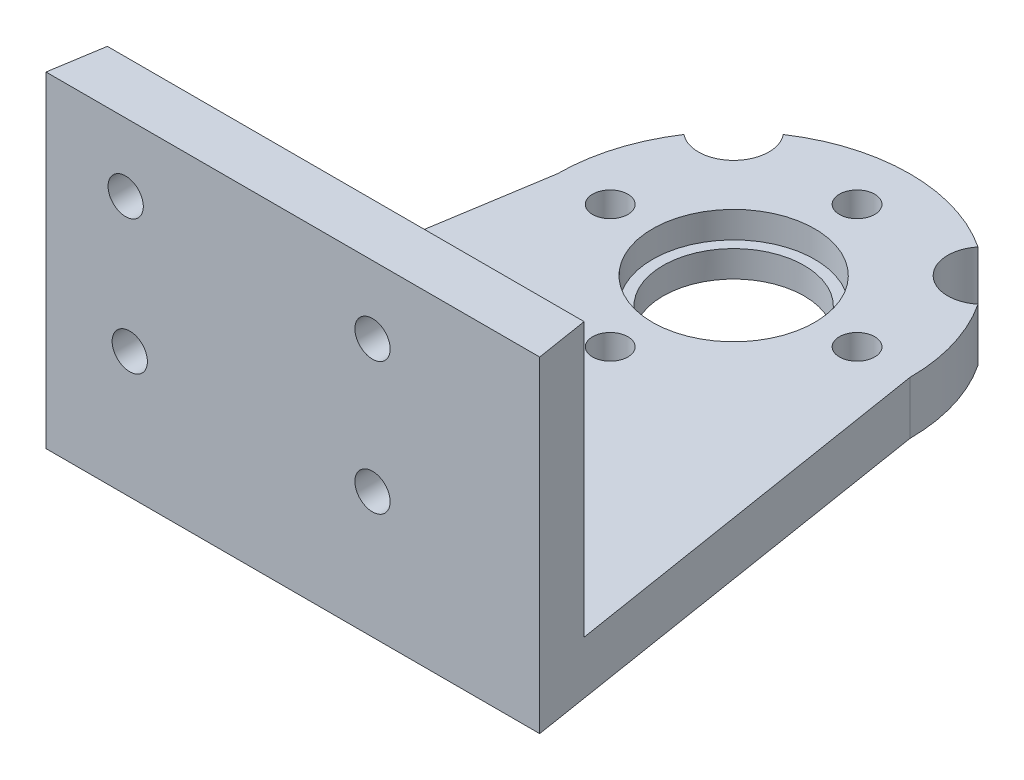
ISO-10303-21;
HEADER;
FILE_DESCRIPTION(('STEP AP214'),'2;1');
FILE_NAME('part.step','',(''),(''),'','','');
FILE_SCHEMA(('AUTOMOTIVE_DESIGN { 1 0 10303 214 1 1 1 1 }'));
ENDSEC;
DATA;
#1=APPLICATION_CONTEXT('core data for automotive mechanical design processes');
#2=APPLICATION_PROTOCOL_DEFINITION('international standard','automotive_design',2000,#1);
#3=PRODUCT_CONTEXT('',#1,'mechanical');
#4=PRODUCT('Part','Part','',(#3));
#5=PRODUCT_RELATED_PRODUCT_CATEGORY('part','',(#4));
#6=PRODUCT_DEFINITION_FORMATION('','',#4);
#7=PRODUCT_DEFINITION_CONTEXT('part definition',#1,'design');
#8=PRODUCT_DEFINITION('design','',#6,#7);
#9=PRODUCT_DEFINITION_SHAPE('','',#8);
#10=(LENGTH_UNIT() NAMED_UNIT(*) SI_UNIT(.MILLI.,.METRE.));
#11=(NAMED_UNIT(*) PLANE_ANGLE_UNIT() SI_UNIT($,.RADIAN.));
#12=(NAMED_UNIT(*) SI_UNIT($,.STERADIAN.) SOLID_ANGLE_UNIT());
#13=UNCERTAINTY_MEASURE_WITH_UNIT(LENGTH_MEASURE(1.E-05),#10,'distance_accuracy_value','');
#14=(GEOMETRIC_REPRESENTATION_CONTEXT(3) GLOBAL_UNCERTAINTY_ASSIGNED_CONTEXT((#13)) GLOBAL_UNIT_ASSIGNED_CONTEXT((#10,
#11,#12)) REPRESENTATION_CONTEXT('',''));
#15=CARTESIAN_POINT('',(0.,0.,0.));
#16=DIRECTION('',(0.,0.,1.));
#17=DIRECTION('',(1.,0.,0.));
#18=AXIS2_PLACEMENT_3D('',#15,#16,#17);
#19=CARTESIAN_POINT('',(0.,3.,0.));
#20=DIRECTION('',(0.,-1.,0.));
#21=DIRECTION('',(0.,0.,-1.));
#22=AXIS2_PLACEMENT_3D('',#19,#20,#21);
#23=CYLINDRICAL_SURFACE('',#22,10.);
#24=CARTESIAN_POINT('',(0.,0.,0.));
#25=DIRECTION('',(0.,1.,0.));
#26=DIRECTION('',(0.,0.,-1.));
#27=AXIS2_PLACEMENT_3D('',#24,#25,#26);
#28=CIRCLE('',#27,10.);
#29=CARTESIAN_POINT('',(10.,0.,0.));
#30=VERTEX_POINT('',#29);
#31=CARTESIAN_POINT('',(8.33677118357518,0.,-5.52252172768116));
#32=VERTEX_POINT('',#31);
#33=EDGE_CURVE('E221',#30,#32,#28,.T.);
#34=ORIENTED_EDGE('',*,*,#33,.T.);
#35=DIRECTION('',(0.,1.,0.));
#36=VECTOR('',#35,1.);
#37=CARTESIAN_POINT('',(8.33677118357519,-2.,-5.52252172768115));
#38=LINE('',#37,#36);
#39=CARTESIAN_POINT('',(8.33677118357519,3.,-5.52252172768115));
#40=VERTEX_POINT('',#39);
#41=EDGE_CURVE('E51',#32,#40,#38,.T.);
#42=ORIENTED_EDGE('',*,*,#41,.T.);
#43=CARTESIAN_POINT('',(0.,3.,0.));
#44=DIRECTION('',(0.,1.,0.));
#45=DIRECTION('',(0.,0.,-1.));
#46=AXIS2_PLACEMENT_3D('',#43,#44,#45);
#47=CIRCLE('',#46,10.);
#48=CARTESIAN_POINT('',(10.,3.,0.));
#49=VERTEX_POINT('',#48);
#50=EDGE_CURVE('E125',#49,#40,#47,.T.);
#51=ORIENTED_EDGE('',*,*,#50,.F.);
#52=DIRECTION('',(0.,-1.,0.));
#53=VECTOR('',#52,1.);
#54=CARTESIAN_POINT('',(10.,3.,0.));
#55=LINE('',#54,#53);
#56=EDGE_CURVE('E149',#49,#30,#55,.T.);
#57=ORIENTED_EDGE('',*,*,#56,.T.);
#58=EDGE_LOOP('',(#34,#42,#51,#57));
#59=FACE_BOUND('',#58,.T.);
#60=ADVANCED_FACE('F37',(#59),#23,.T.);
#61=CARTESIAN_POINT('',(5.52252172768112,3.,-8.33677118357521));
#62=VERTEX_POINT('',#61);
#63=CARTESIAN_POINT('',(-5.52252172768112,3.,-8.33677118357521));
#64=VERTEX_POINT('',#63);
#65=EDGE_CURVE('E122',#62,#64,#47,.T.);
#66=ORIENTED_EDGE('',*,*,#65,.F.);
#67=DIRECTION('',(0.,1.,0.));
#68=VECTOR('',#67,1.);
#69=CARTESIAN_POINT('',(5.52252172768112,-2.,-8.33677118357521));
#70=LINE('',#69,#68);
#71=CARTESIAN_POINT('',(5.52252172768113,0.,-8.3367711835752));
#72=VERTEX_POINT('',#71);
#73=EDGE_CURVE('E112',#62,#72,#70,.F.);
#74=ORIENTED_EDGE('',*,*,#73,.T.);
#75=CARTESIAN_POINT('',(-5.52252172768113,0.,-8.3367711835752));
#76=VERTEX_POINT('',#75);
#77=EDGE_CURVE('E59',#72,#76,#28,.T.);
#78=ORIENTED_EDGE('',*,*,#77,.T.);
#79=DIRECTION('',(0.,1.,0.));
#80=VECTOR('',#79,1.);
#81=CARTESIAN_POINT('',(-5.52252172768112,-2.,-8.33677118357521));
#82=LINE('',#81,#80);
#83=EDGE_CURVE('E129',#76,#64,#82,.T.);
#84=ORIENTED_EDGE('',*,*,#83,.T.);
#85=EDGE_LOOP('',(#66,#74,#78,#84));
#86=FACE_BOUND('',#85,.T.);
#87=ADVANCED_FACE('F128',(#86),#23,.T.);
#88=CARTESIAN_POINT('',(0.,-10.,0.));
#89=DIRECTION('',(0.,1.,0.));
#90=DIRECTION('',(0.,0.,1.));
#91=AXIS2_PLACEMENT_3D('',#88,#89,#90);
#92=CYLINDRICAL_SURFACE('',#91,4.);
#93=CARTESIAN_POINT('',(0.,0.,0.));
#94=DIRECTION('',(0.,-1.,0.));
#95=DIRECTION('',(0.,0.,-1.));
#96=AXIS2_PLACEMENT_3D('',#93,#94,#95);
#97=CIRCLE('',#96,4.);
#98=CARTESIAN_POINT('',(0.,0.,-4.));
#99=VERTEX_POINT('',#98);
#100=EDGE_CURVE('E217',#99,#99,#97,.T.);
#101=ORIENTED_EDGE('',*,*,#100,.T.);
#102=EDGE_LOOP('',(#101));
#103=FACE_BOUND('',#102,.T.);
#104=CARTESIAN_POINT('',(0.,1.5,0.));
#105=DIRECTION('',(0.,1.,0.));
#106=DIRECTION('',(0.,0.,1.));
#107=AXIS2_PLACEMENT_3D('',#104,#105,#106);
#108=CIRCLE('',#107,4.);
#109=CARTESIAN_POINT('',(0.,1.5,4.));
#110=VERTEX_POINT('',#109);
#111=EDGE_CURVE('E155',#110,#110,#108,.F.);
#112=ORIENTED_EDGE('',*,*,#111,.F.);
#113=EDGE_LOOP('',(#112));
#114=FACE_BOUND('',#113,.T.);
#115=ADVANCED_FACE('F352',(#103,#114),#92,.F.);
#116=CARTESIAN_POINT('',(0.,3.,0.));
#117=DIRECTION('',(0.,-1.,0.));
#118=DIRECTION('',(0.,0.,-1.));
#119=AXIS2_PLACEMENT_3D('',#116,#117,#118);
#120=PLANE('',#119);
#121=CARTESIAN_POINT('',(0.,3.,0.));
#122=DIRECTION('',(0.,1.,0.));
#123=DIRECTION('',(0.,0.,1.));
#124=AXIS2_PLACEMENT_3D('',#121,#122,#123);
#125=CIRCLE('',#124,4.6);
#126=CARTESIAN_POINT('',(0.,3.,4.6));
#127=VERTEX_POINT('',#126);
#128=EDGE_CURVE('E276',#127,#127,#125,.T.);
#129=ORIENTED_EDGE('',*,*,#128,.F.);
#130=EDGE_LOOP('',(#129));
#131=FACE_BOUND('',#130,.T.);
#132=CARTESIAN_POINT('',(-6.52,3.,19.));
#133=DIRECTION('',(0.,1.,0.));
#134=DIRECTION('',(0.,0.,1.));
#135=AXIS2_PLACEMENT_3D('',#132,#133,#134);
#136=CIRCLE('',#135,1.);
#137=CARTESIAN_POINT('',(-6.52,3.,20.));
#138=VERTEX_POINT('',#137);
#139=EDGE_CURVE('E136',#138,#138,#136,.T.);
#140=ORIENTED_EDGE('',*,*,#139,.F.);
#141=EDGE_LOOP('',(#140));
#142=FACE_BOUND('',#141,.T.);
#143=CARTESIAN_POINT('',(6.52,3.,19.));
#144=DIRECTION('',(0.,1.,0.));
#145=DIRECTION('',(0.,0.,-1.));
#146=AXIS2_PLACEMENT_3D('',#143,#144,#145);
#147=CIRCLE('',#146,1.);
#148=CARTESIAN_POINT('',(6.52,3.,18.));
#149=VERTEX_POINT('',#148);
#150=EDGE_CURVE('E190',#149,#149,#147,.T.);
#151=ORIENTED_EDGE('',*,*,#150,.F.);
#152=EDGE_LOOP('',(#151));
#153=FACE_BOUND('',#152,.T.);
#154=CARTESIAN_POINT('',(0.,3.,19.));
#155=DIRECTION('',(0.,1.,0.));
#156=DIRECTION('',(0.,0.,1.));
#157=AXIS2_PLACEMENT_3D('',#154,#155,#156);
#158=CIRCLE('',#157,1.);
#159=CARTESIAN_POINT('',(0.,3.,20.));
#160=VERTEX_POINT('',#159);
#161=EDGE_CURVE('E186',#160,#160,#158,.T.);
#162=ORIENTED_EDGE('',*,*,#161,.F.);
#163=EDGE_LOOP('',(#162));
#164=FACE_BOUND('',#163,.T.);
#165=CARTESIAN_POINT('',(0.,3.,7.));
#166=DIRECTION('',(0.,1.,0.));
#167=DIRECTION('',(0.,0.,1.));
#168=AXIS2_PLACEMENT_3D('',#165,#166,#167);
#169=CIRCLE('',#168,1.);
#170=CARTESIAN_POINT('',(0.,3.,8.));
#171=VERTEX_POINT('',#170);
#172=EDGE_CURVE('E180',#171,#171,#169,.T.);
#173=ORIENTED_EDGE('',*,*,#172,.F.);
#174=EDGE_LOOP('',(#173));
#175=FACE_BOUND('',#174,.T.);
#176=CARTESIAN_POINT('',(-7.,3.,0.));
#177=DIRECTION('',(0.,1.,0.));
#178=DIRECTION('',(0.,0.,1.));
#179=AXIS2_PLACEMENT_3D('',#176,#177,#178);
#180=CIRCLE('',#179,1.);
#181=CARTESIAN_POINT('',(-7.,3.,0.999999999999975));
#182=VERTEX_POINT('',#181);
#183=EDGE_CURVE('E174',#182,#182,#180,.T.);
#184=ORIENTED_EDGE('',*,*,#183,.F.);
#185=EDGE_LOOP('',(#184));
#186=FACE_BOUND('',#185,.T.);
#187=CARTESIAN_POINT('',(0.,3.,-7.));
#188=DIRECTION('',(0.,1.,0.));
#189=DIRECTION('',(0.,0.,1.));
#190=AXIS2_PLACEMENT_3D('',#187,#188,#189);
#191=CIRCLE('',#190,1.);
#192=CARTESIAN_POINT('',(0.,3.,-6.));
#193=VERTEX_POINT('',#192);
#194=EDGE_CURVE('E166',#193,#193,#191,.T.);
#195=ORIENTED_EDGE('',*,*,#194,.F.);
#196=EDGE_LOOP('',(#195));
#197=FACE_BOUND('',#196,.T.);
#198=CARTESIAN_POINT('',(7.,3.,0.));
#199=DIRECTION('',(0.,1.,0.));
#200=DIRECTION('',(0.,0.,1.));
#201=AXIS2_PLACEMENT_3D('',#198,#199,#200);
#202=CIRCLE('',#201,1.);
#203=CARTESIAN_POINT('',(7.,3.,1.00000000000007));
#204=VERTEX_POINT('',#203);
#205=EDGE_CURVE('E167',#204,#204,#202,.T.);
#206=ORIENTED_EDGE('',*,*,#205,.F.);
#207=EDGE_LOOP('',(#206));
#208=FACE_BOUND('',#207,.T.);
#209=ORIENTED_EDGE('',*,*,#50,.T.);
#210=CARTESIAN_POINT('',(7.07106781186546,3.,-7.07106781186549));
#211=DIRECTION('',(0.,1.,0.));
#212=DIRECTION('',(0.,0.,-1.));
#213=AXIS2_PLACEMENT_3D('',#210,#211,#212);
#214=CIRCLE('',#213,2.);
#215=EDGE_CURVE('E115',#62,#40,#214,.T.);
#216=ORIENTED_EDGE('',*,*,#215,.F.);
#217=ORIENTED_EDGE('',*,*,#65,.T.);
#218=CARTESIAN_POINT('',(-7.07106781186546,3.,-7.07106781186549));
#219=DIRECTION('',(0.,1.,0.));
#220=DIRECTION('',(0.,0.,1.));
#221=AXIS2_PLACEMENT_3D('',#218,#219,#220);
#222=CIRCLE('',#221,2.);
#223=CARTESIAN_POINT('',(-8.33677118357519,3.,-5.52252172768115));
#224=VERTEX_POINT('',#223);
#225=EDGE_CURVE('E284',#224,#64,#222,.T.);
#226=ORIENTED_EDGE('',*,*,#225,.F.);
#227=CARTESIAN_POINT('',(-10.,3.,0.));
#228=VERTEX_POINT('',#227);
#229=EDGE_CURVE('E130',#224,#228,#47,.T.);
#230=ORIENTED_EDGE('',*,*,#229,.T.);
#231=DIRECTION('',(-0.157990501106673,0.,0.987440631916705));
#232=VECTOR('',#231,1.);
#233=CARTESIAN_POINT('',(-10.,3.,0.));
#234=LINE('',#233,#232);
#235=CARTESIAN_POINT('',(-13.52,3.,22.));
#236=VERTEX_POINT('',#235);
#237=EDGE_CURVE('E132',#228,#236,#234,.T.);
#238=ORIENTED_EDGE('',*,*,#237,.T.);
#239=DIRECTION('',(-1.,0.,0.));
#240=VECTOR('',#239,1.);
#241=CARTESIAN_POINT('',(-13.52,3.,22.));
#242=LINE('',#241,#240);
#243=CARTESIAN_POINT('',(13.52,3.,22.));
#244=VERTEX_POINT('',#243);
#245=EDGE_CURVE('E150',#244,#236,#242,.T.);
#246=ORIENTED_EDGE('',*,*,#245,.F.);
#247=DIRECTION('',(-0.157990501106673,0.,-0.987440631916705));
#248=VECTOR('',#247,1.);
#249=CARTESIAN_POINT('',(10.,3.,0.));
#250=LINE('',#249,#248);
#251=EDGE_CURVE('E145',#244,#49,#250,.T.);
#252=ORIENTED_EDGE('',*,*,#251,.T.);
#253=EDGE_LOOP('',(#209,#216,#217,#226,#230,#238,#246,#252));
#254=FACE_BOUND('',#253,.T.);
#255=ADVANCED_FACE('F120',(#131,#142,#153,#164,#175,#186,#197,#208,#254),#120,.F.);
#256=ORIENTED_EDGE('',*,*,#229,.F.);
#257=DIRECTION('',(0.,1.,0.));
#258=VECTOR('',#257,1.);
#259=CARTESIAN_POINT('',(-8.33677118357519,-2.,-5.52252172768115));
#260=LINE('',#259,#258);
#261=CARTESIAN_POINT('',(-8.33677118357518,0.,-5.52252172768116));
#262=VERTEX_POINT('',#261);
#263=EDGE_CURVE('E282',#224,#262,#260,.F.);
#264=ORIENTED_EDGE('',*,*,#263,.T.);
#265=CARTESIAN_POINT('',(-10.,0.,0.));
#266=VERTEX_POINT('',#265);
#267=EDGE_CURVE('E219',#262,#266,#28,.T.);
#268=ORIENTED_EDGE('',*,*,#267,.T.);
#269=DIRECTION('',(0.,-1.,0.));
#270=VECTOR('',#269,1.);
#271=CARTESIAN_POINT('',(-10.,3.,0.));
#272=LINE('',#271,#270);
#273=EDGE_CURVE('E224',#228,#266,#272,.T.);
#274=ORIENTED_EDGE('',*,*,#273,.F.);
#275=EDGE_LOOP('',(#256,#264,#268,#274));
#276=FACE_BOUND('',#275,.T.);
#277=ADVANCED_FACE('F39',(#276),#23,.T.);
#278=CARTESIAN_POINT('',(-10.,3.,0.));
#279=DIRECTION('',(0.987440631916705,0.,0.157990501106673));
#280=DIRECTION('',(0.157990501106673,0.,-0.987440631916705));
#281=AXIS2_PLACEMENT_3D('',#278,#279,#280);
#282=PLANE('',#281);
#283=DIRECTION('',(-0.157990501106673,0.,0.987440631916705));
#284=VECTOR('',#283,1.);
#285=CARTESIAN_POINT('',(-10.,0.,0.));
#286=LINE('',#285,#284);
#287=CARTESIAN_POINT('',(-14.,0.,25.));
#288=VERTEX_POINT('',#287);
#289=EDGE_CURVE('E238',#266,#288,#286,.T.);
#290=ORIENTED_EDGE('',*,*,#289,.T.);
#291=DIRECTION('',(0.,-1.,0.));
#292=VECTOR('',#291,1.);
#293=CARTESIAN_POINT('',(-14.,3.,25.));
#294=LINE('',#293,#292);
#295=CARTESIAN_POINT('',(-14.,18.5,25.));
#296=VERTEX_POINT('',#295);
#297=EDGE_CURVE('E227',#296,#288,#294,.T.);
#298=ORIENTED_EDGE('',*,*,#297,.F.);
#299=DIRECTION('',(-0.157990501106673,0.,0.987440631916705));
#300=VECTOR('',#299,1.);
#301=CARTESIAN_POINT('',(-13.52,18.5,22.));
#302=LINE('',#301,#300);
#303=CARTESIAN_POINT('',(-13.52,18.5,22.));
#304=VERTEX_POINT('',#303);
#305=EDGE_CURVE('E154',#304,#296,#302,.T.);
#306=ORIENTED_EDGE('',*,*,#305,.F.);
#307=DIRECTION('',(0.,-1.,0.));
#308=VECTOR('',#307,1.);
#309=CARTESIAN_POINT('',(-13.52,18.5,22.));
#310=LINE('',#309,#308);
#311=EDGE_CURVE('E156',#304,#236,#310,.T.);
#312=ORIENTED_EDGE('',*,*,#311,.T.);
#313=ORIENTED_EDGE('',*,*,#237,.F.);
#314=ORIENTED_EDGE('',*,*,#273,.T.);
#315=EDGE_LOOP('',(#290,#298,#306,#312,#313,#314));
#316=FACE_BOUND('',#315,.T.);
#317=ADVANCED_FACE('F330',(#316),#282,.F.);
#318=CARTESIAN_POINT('',(-14.,3.,25.));
#319=DIRECTION('',(0.,0.,-1.));
#320=DIRECTION('',(-1.,0.,0.));
#321=AXIS2_PLACEMENT_3D('',#318,#319,#320);
#322=PLANE('',#321);
#323=CARTESIAN_POINT('',(-9.2488324446185,7.15183711810604,25.));
#324=DIRECTION('',(0.,0.,-1.));
#325=DIRECTION('',(-1.,0.,0.));
#326=AXIS2_PLACEMENT_3D('',#323,#324,#325);
#327=CIRCLE('',#326,1.00000000002297);
#328=CARTESIAN_POINT('',(-10.2488324446415,7.15183711810604,25.));
#329=VERTEX_POINT('',#328);
#330=EDGE_CURVE('E304',#329,#329,#327,.T.);
#331=ORIENTED_EDGE('',*,*,#330,.T.);
#332=EDGE_LOOP('',(#331));
#333=FACE_BOUND('',#332,.T.);
#334=CARTESIAN_POINT('',(-9.48122486488463,14.651837118106,25.));
#335=DIRECTION('',(0.,0.,-1.));
#336=DIRECTION('',(-1.,0.,0.));
#337=AXIS2_PLACEMENT_3D('',#334,#335,#336);
#338=CIRCLE('',#337,1.00000000002297);
#339=CARTESIAN_POINT('',(-10.4812248649076,14.651837118106,25.));
#340=VERTEX_POINT('',#339);
#341=EDGE_CURVE('E298',#340,#340,#338,.T.);
#342=ORIENTED_EDGE('',*,*,#341,.T.);
#343=EDGE_LOOP('',(#342));
#344=FACE_BOUND('',#343,.T.);
#345=CARTESIAN_POINT('',(4.51877513511538,14.651837118106,25.));
#346=DIRECTION('',(0.,0.,-1.));
#347=DIRECTION('',(-1.,0.,0.));
#348=AXIS2_PLACEMENT_3D('',#345,#346,#347);
#349=CIRCLE('',#348,1.00000000002297);
#350=CARTESIAN_POINT('',(3.51877513509241,14.651837118106,25.));
#351=VERTEX_POINT('',#350);
#352=EDGE_CURVE('E292',#351,#351,#349,.T.);
#353=ORIENTED_EDGE('',*,*,#352,.T.);
#354=EDGE_LOOP('',(#353));
#355=FACE_BOUND('',#354,.T.);
#356=CARTESIAN_POINT('',(4.51877513511538,7.15183711810605,25.));
#357=DIRECTION('',(0.,0.,-1.));
#358=DIRECTION('',(-1.,0.,0.));
#359=AXIS2_PLACEMENT_3D('',#356,#357,#358);
#360=CIRCLE('',#359,1.00000000002297);
#361=CARTESIAN_POINT('',(3.51877513509241,7.15183711810605,25.));
#362=VERTEX_POINT('',#361);
#363=EDGE_CURVE('E126',#362,#362,#360,.T.);
#364=ORIENTED_EDGE('',*,*,#363,.T.);
#365=EDGE_LOOP('',(#364));
#366=FACE_BOUND('',#365,.T.);
#367=DIRECTION('',(1.,0.,0.));
#368=VECTOR('',#367,1.);
#369=CARTESIAN_POINT('',(-14.,0.,25.));
#370=LINE('',#369,#368);
#371=CARTESIAN_POINT('',(14.,0.,25.));
#372=VERTEX_POINT('',#371);
#373=EDGE_CURVE('E236',#288,#372,#370,.T.);
#374=ORIENTED_EDGE('',*,*,#373,.T.);
#375=DIRECTION('',(0.,-1.,0.));
#376=VECTOR('',#375,1.);
#377=CARTESIAN_POINT('',(14.,3.,25.));
#378=LINE('',#377,#376);
#379=CARTESIAN_POINT('',(14.,18.5,25.));
#380=VERTEX_POINT('',#379);
#381=EDGE_CURVE('E230',#380,#372,#378,.T.);
#382=ORIENTED_EDGE('',*,*,#381,.F.);
#383=DIRECTION('',(1.,0.,0.));
#384=VECTOR('',#383,1.);
#385=CARTESIAN_POINT('',(-14.,18.5,25.));
#386=LINE('',#385,#384);
#387=EDGE_CURVE('E270',#296,#380,#386,.T.);
#388=ORIENTED_EDGE('',*,*,#387,.F.);
#389=ORIENTED_EDGE('',*,*,#297,.T.);
#390=EDGE_LOOP('',(#374,#382,#388,#389));
#391=FACE_BOUND('',#390,.T.);
#392=ADVANCED_FACE('F329',(#333,#344,#355,#366,#391),#322,.F.);
#393=CARTESIAN_POINT('',(10.,3.,0.));
#394=DIRECTION('',(-0.987440631916705,0.,0.157990501106673));
#395=DIRECTION('',(0.157990501106673,0.,0.987440631916705));
#396=AXIS2_PLACEMENT_3D('',#393,#394,#395);
#397=PLANE('',#396);
#398=DIRECTION('',(-0.157990501106673,0.,-0.987440631916705));
#399=VECTOR('',#398,1.);
#400=CARTESIAN_POINT('',(10.,0.,0.));
#401=LINE('',#400,#399);
#402=EDGE_CURVE('E133',#372,#30,#401,.T.);
#403=ORIENTED_EDGE('',*,*,#402,.T.);
#404=ORIENTED_EDGE('',*,*,#56,.F.);
#405=ORIENTED_EDGE('',*,*,#251,.F.);
#406=DIRECTION('',(0.,-1.,0.));
#407=VECTOR('',#406,1.);
#408=CARTESIAN_POINT('',(13.52,18.5,22.));
#409=LINE('',#408,#407);
#410=CARTESIAN_POINT('',(13.52,18.5,22.));
#411=VERTEX_POINT('',#410);
#412=EDGE_CURVE('E170',#411,#244,#409,.T.);
#413=ORIENTED_EDGE('',*,*,#412,.F.);
#414=DIRECTION('',(-0.157990501106673,0.,-0.987440631916705));
#415=VECTOR('',#414,1.);
#416=CARTESIAN_POINT('',(14.,18.5,25.));
#417=LINE('',#416,#415);
#418=EDGE_CURVE('E267',#380,#411,#417,.T.);
#419=ORIENTED_EDGE('',*,*,#418,.F.);
#420=ORIENTED_EDGE('',*,*,#381,.T.);
#421=EDGE_LOOP('',(#403,#404,#405,#413,#419,#420));
#422=FACE_BOUND('',#421,.T.);
#423=ADVANCED_FACE('F206',(#422),#397,.F.);
#424=CARTESIAN_POINT('',(0.,0.,0.));
#425=DIRECTION('',(0.,-1.,0.));
#426=DIRECTION('',(0.,0.,-1.));
#427=AXIS2_PLACEMENT_3D('',#424,#425,#426);
#428=PLANE('',#427);
#429=CARTESIAN_POINT('',(7.07106781186546,0.,-7.07106781186549));
#430=DIRECTION('',(0.,-1.,0.));
#431=DIRECTION('',(0.,0.,-1.));
#432=AXIS2_PLACEMENT_3D('',#429,#430,#431);
#433=CIRCLE('',#432,2.);
#434=EDGE_CURVE('E11',#32,#72,#433,.T.);
#435=ORIENTED_EDGE('',*,*,#434,.F.);
#436=ORIENTED_EDGE('',*,*,#33,.F.);
#437=ORIENTED_EDGE('',*,*,#402,.F.);
#438=ORIENTED_EDGE('',*,*,#373,.F.);
#439=ORIENTED_EDGE('',*,*,#289,.F.);
#440=ORIENTED_EDGE('',*,*,#267,.F.);
#441=CARTESIAN_POINT('',(-7.07106781186546,0.,-7.07106781186549));
#442=DIRECTION('',(0.,-1.,0.));
#443=DIRECTION('',(0.,0.,-1.));
#444=AXIS2_PLACEMENT_3D('',#441,#442,#443);
#445=CIRCLE('',#444,2.);
#446=EDGE_CURVE('E45',#76,#262,#445,.T.);
#447=ORIENTED_EDGE('',*,*,#446,.F.);
#448=ORIENTED_EDGE('',*,*,#77,.F.);
#449=EDGE_LOOP('',(#435,#436,#437,#438,#439,#440,#447,#448));
#450=FACE_BOUND('',#449,.T.);
#451=CARTESIAN_POINT('',(7.,0.,0.));
#452=DIRECTION('',(0.,1.,0.));
#453=DIRECTION('',(0.,0.,1.));
#454=AXIS2_PLACEMENT_3D('',#451,#452,#453);
#455=CIRCLE('',#454,1.);
#456=CARTESIAN_POINT('',(7.,0.,1.00000000000007));
#457=VERTEX_POINT('',#456);
#458=EDGE_CURVE('E163',#457,#457,#455,.T.);
#459=ORIENTED_EDGE('',*,*,#458,.T.);
#460=EDGE_LOOP('',(#459));
#461=FACE_BOUND('',#460,.T.);
#462=CARTESIAN_POINT('',(0.,0.,-7.));
#463=DIRECTION('',(0.,1.,0.));
#464=DIRECTION('',(0.,0.,1.));
#465=AXIS2_PLACEMENT_3D('',#462,#463,#464);
#466=CIRCLE('',#465,1.);
#467=CARTESIAN_POINT('',(0.,0.,-6.));
#468=VERTEX_POINT('',#467);
#469=EDGE_CURVE('E171',#468,#468,#466,.T.);
#470=ORIENTED_EDGE('',*,*,#469,.T.);
#471=EDGE_LOOP('',(#470));
#472=FACE_BOUND('',#471,.T.);
#473=CARTESIAN_POINT('',(-7.,0.,0.));
#474=DIRECTION('',(0.,1.,0.));
#475=DIRECTION('',(0.,0.,1.));
#476=AXIS2_PLACEMENT_3D('',#473,#474,#475);
#477=CIRCLE('',#476,1.);
#478=CARTESIAN_POINT('',(-7.,0.,0.999999999999975));
#479=VERTEX_POINT('',#478);
#480=EDGE_CURVE('E177',#479,#479,#477,.T.);
#481=ORIENTED_EDGE('',*,*,#480,.T.);
#482=EDGE_LOOP('',(#481));
#483=FACE_BOUND('',#482,.T.);
#484=CARTESIAN_POINT('',(0.,0.,7.));
#485=DIRECTION('',(0.,1.,0.));
#486=DIRECTION('',(0.,0.,1.));
#487=AXIS2_PLACEMENT_3D('',#484,#485,#486);
#488=CIRCLE('',#487,1.);
#489=CARTESIAN_POINT('',(0.,0.,8.));
#490=VERTEX_POINT('',#489);
#491=EDGE_CURVE('E183',#490,#490,#488,.T.);
#492=ORIENTED_EDGE('',*,*,#491,.T.);
#493=EDGE_LOOP('',(#492));
#494=FACE_BOUND('',#493,.T.);
#495=CARTESIAN_POINT('',(0.,0.,19.));
#496=DIRECTION('',(0.,-1.,0.));
#497=DIRECTION('',(0.,0.,-1.));
#498=AXIS2_PLACEMENT_3D('',#495,#496,#497);
#499=CIRCLE('',#498,1.);
#500=CARTESIAN_POINT('',(0.,0.,18.));
#501=VERTEX_POINT('',#500);
#502=EDGE_CURVE('E146',#501,#501,#499,.T.);
#503=ORIENTED_EDGE('',*,*,#502,.F.);
#504=EDGE_LOOP('',(#503));
#505=FACE_BOUND('',#504,.T.);
#506=CARTESIAN_POINT('',(6.52,0.,19.));
#507=DIRECTION('',(0.,-1.,0.));
#508=DIRECTION('',(0.,0.,-1.));
#509=AXIS2_PLACEMENT_3D('',#506,#507,#508);
#510=CIRCLE('',#509,1.);
#511=CARTESIAN_POINT('',(6.52,0.,18.));
#512=VERTEX_POINT('',#511);
#513=EDGE_CURVE('E192',#512,#512,#510,.T.);
#514=ORIENTED_EDGE('',*,*,#513,.F.);
#515=EDGE_LOOP('',(#514));
#516=FACE_BOUND('',#515,.T.);
#517=CARTESIAN_POINT('',(-6.52,0.,19.));
#518=DIRECTION('',(0.,-1.,0.));
#519=DIRECTION('',(0.,0.,-1.));
#520=AXIS2_PLACEMENT_3D('',#517,#518,#519);
#521=CIRCLE('',#520,1.);
#522=CARTESIAN_POINT('',(-6.52,0.,18.));
#523=VERTEX_POINT('',#522);
#524=EDGE_CURVE('E214',#523,#523,#521,.T.);
#525=ORIENTED_EDGE('',*,*,#524,.F.);
#526=EDGE_LOOP('',(#525));
#527=FACE_BOUND('',#526,.T.);
#528=ORIENTED_EDGE('',*,*,#100,.F.);
#529=EDGE_LOOP('',(#528));
#530=FACE_BOUND('',#529,.T.);
#531=ADVANCED_FACE('F202',(#450,#461,#472,#483,#494,#505,#516,#527,#530),#428,.T.);
#532=CARTESIAN_POINT('',(-6.52,-10.,19.));
#533=DIRECTION('',(0.,1.,0.));
#534=DIRECTION('',(0.,0.,1.));
#535=AXIS2_PLACEMENT_3D('',#532,#533,#534);
#536=CYLINDRICAL_SURFACE('',#535,1.);
#537=ORIENTED_EDGE('',*,*,#524,.T.);
#538=EDGE_LOOP('',(#537));
#539=FACE_BOUND('',#538,.T.);
#540=ORIENTED_EDGE('',*,*,#139,.T.);
#541=EDGE_LOOP('',(#540));
#542=FACE_BOUND('',#541,.T.);
#543=ADVANCED_FACE('F205',(#539,#542),#536,.F.);
#544=CARTESIAN_POINT('',(6.52,-10.,19.));
#545=DIRECTION('',(0.,1.,0.));
#546=DIRECTION('',(0.,0.,1.));
#547=AXIS2_PLACEMENT_3D('',#544,#545,#546);
#548=CYLINDRICAL_SURFACE('',#547,1.);
#549=ORIENTED_EDGE('',*,*,#513,.T.);
#550=EDGE_LOOP('',(#549));
#551=FACE_BOUND('',#550,.T.);
#552=ORIENTED_EDGE('',*,*,#150,.T.);
#553=EDGE_LOOP('',(#552));
#554=FACE_BOUND('',#553,.T.);
#555=ADVANCED_FACE('F490',(#551,#554),#548,.F.);
#556=CARTESIAN_POINT('',(0.,-10.,19.));
#557=DIRECTION('',(0.,1.,0.));
#558=DIRECTION('',(0.,0.,1.));
#559=AXIS2_PLACEMENT_3D('',#556,#557,#558);
#560=CYLINDRICAL_SURFACE('',#559,1.);
#561=ORIENTED_EDGE('',*,*,#502,.T.);
#562=EDGE_LOOP('',(#561));
#563=FACE_BOUND('',#562,.T.);
#564=ORIENTED_EDGE('',*,*,#161,.T.);
#565=EDGE_LOOP('',(#564));
#566=FACE_BOUND('',#565,.T.);
#567=ADVANCED_FACE('F199',(#563,#566),#560,.F.);
#568=CARTESIAN_POINT('',(0.,0.,7.));
#569=DIRECTION('',(0.,1.,0.));
#570=DIRECTION('',(0.,0.,1.));
#571=AXIS2_PLACEMENT_3D('',#568,#569,#570);
#572=CYLINDRICAL_SURFACE('',#571,1.);
#573=ORIENTED_EDGE('',*,*,#491,.F.);
#574=EDGE_LOOP('',(#573));
#575=FACE_BOUND('',#574,.T.);
#576=ORIENTED_EDGE('',*,*,#172,.T.);
#577=EDGE_LOOP('',(#576));
#578=FACE_BOUND('',#577,.T.);
#579=ADVANCED_FACE('F503',(#575,#578),#572,.F.);
#580=CARTESIAN_POINT('',(-7.,0.,0.));
#581=DIRECTION('',(0.,1.,0.));
#582=DIRECTION('',(0.,0.,1.));
#583=AXIS2_PLACEMENT_3D('',#580,#581,#582);
#584=CYLINDRICAL_SURFACE('',#583,1.);
#585=ORIENTED_EDGE('',*,*,#480,.F.);
#586=EDGE_LOOP('',(#585));
#587=FACE_BOUND('',#586,.T.);
#588=ORIENTED_EDGE('',*,*,#183,.T.);
#589=EDGE_LOOP('',(#588));
#590=FACE_BOUND('',#589,.T.);
#591=ADVANCED_FACE('F510',(#587,#590),#584,.F.);
#592=CARTESIAN_POINT('',(0.,0.,-7.));
#593=DIRECTION('',(0.,1.,0.));
#594=DIRECTION('',(0.,0.,1.));
#595=AXIS2_PLACEMENT_3D('',#592,#593,#594);
#596=CYLINDRICAL_SURFACE('',#595,1.);
#597=ORIENTED_EDGE('',*,*,#469,.F.);
#598=EDGE_LOOP('',(#597));
#599=FACE_BOUND('',#598,.T.);
#600=ORIENTED_EDGE('',*,*,#194,.T.);
#601=EDGE_LOOP('',(#600));
#602=FACE_BOUND('',#601,.T.);
#603=ADVANCED_FACE('F517',(#599,#602),#596,.F.);
#604=CARTESIAN_POINT('',(7.,0.,0.));
#605=DIRECTION('',(0.,1.,0.));
#606=DIRECTION('',(0.,0.,1.));
#607=AXIS2_PLACEMENT_3D('',#604,#605,#606);
#608=CYLINDRICAL_SURFACE('',#607,1.);
#609=ORIENTED_EDGE('',*,*,#458,.F.);
#610=EDGE_LOOP('',(#609));
#611=FACE_BOUND('',#610,.T.);
#612=ORIENTED_EDGE('',*,*,#205,.T.);
#613=EDGE_LOOP('',(#612));
#614=FACE_BOUND('',#613,.T.);
#615=ADVANCED_FACE('F318',(#611,#614),#608,.F.);
#616=CARTESIAN_POINT('',(-13.52,18.5,22.));
#617=DIRECTION('',(0.,0.,1.));
#618=DIRECTION('',(1.,0.,0.));
#619=AXIS2_PLACEMENT_3D('',#616,#617,#618);
#620=PLANE('',#619);
#621=CARTESIAN_POINT('',(-9.2488324446185,7.15183711810604,22.));
#622=DIRECTION('',(0.,0.,-1.));
#623=DIRECTION('',(-1.,0.,0.));
#624=AXIS2_PLACEMENT_3D('',#621,#622,#623);
#625=CIRCLE('',#624,1.00000000002297);
#626=CARTESIAN_POINT('',(-10.2488324446415,7.15183711810604,22.));
#627=VERTEX_POINT('',#626);
#628=EDGE_CURVE('E307',#627,#627,#625,.T.);
#629=ORIENTED_EDGE('',*,*,#628,.F.);
#630=EDGE_LOOP('',(#629));
#631=FACE_BOUND('',#630,.T.);
#632=CARTESIAN_POINT('',(-9.48122486488463,14.651837118106,22.));
#633=DIRECTION('',(0.,0.,-1.));
#634=DIRECTION('',(-1.,0.,0.));
#635=AXIS2_PLACEMENT_3D('',#632,#633,#634);
#636=CIRCLE('',#635,1.00000000002297);
#637=CARTESIAN_POINT('',(-10.4812248649076,14.651837118106,22.));
#638=VERTEX_POINT('',#637);
#639=EDGE_CURVE('E301',#638,#638,#636,.T.);
#640=ORIENTED_EDGE('',*,*,#639,.F.);
#641=EDGE_LOOP('',(#640));
#642=FACE_BOUND('',#641,.T.);
#643=CARTESIAN_POINT('',(4.51877513511538,14.651837118106,22.));
#644=DIRECTION('',(0.,0.,-1.));
#645=DIRECTION('',(-1.,0.,0.));
#646=AXIS2_PLACEMENT_3D('',#643,#644,#645);
#647=CIRCLE('',#646,1.00000000002297);
#648=CARTESIAN_POINT('',(3.51877513509241,14.651837118106,22.));
#649=VERTEX_POINT('',#648);
#650=EDGE_CURVE('E295',#649,#649,#647,.T.);
#651=ORIENTED_EDGE('',*,*,#650,.F.);
#652=EDGE_LOOP('',(#651));
#653=FACE_BOUND('',#652,.T.);
#654=CARTESIAN_POINT('',(4.51877513511538,7.15183711810605,22.));
#655=DIRECTION('',(0.,0.,-1.));
#656=DIRECTION('',(-1.,0.,0.));
#657=AXIS2_PLACEMENT_3D('',#654,#655,#656);
#658=CIRCLE('',#657,1.00000000002297);
#659=CARTESIAN_POINT('',(3.51877513509241,7.15183711810605,22.));
#660=VERTEX_POINT('',#659);
#661=EDGE_CURVE('E289',#660,#660,#658,.T.);
#662=ORIENTED_EDGE('',*,*,#661,.F.);
#663=EDGE_LOOP('',(#662));
#664=FACE_BOUND('',#663,.T.);
#665=ORIENTED_EDGE('',*,*,#245,.T.);
#666=ORIENTED_EDGE('',*,*,#311,.F.);
#667=DIRECTION('',(-1.,0.,0.));
#668=VECTOR('',#667,1.);
#669=CARTESIAN_POINT('',(-13.52,18.5,22.));
#670=LINE('',#669,#668);
#671=EDGE_CURVE('E161',#411,#304,#670,.T.);
#672=ORIENTED_EDGE('',*,*,#671,.F.);
#673=ORIENTED_EDGE('',*,*,#412,.T.);
#674=EDGE_LOOP('',(#665,#666,#672,#673));
#675=FACE_BOUND('',#674,.T.);
#676=ADVANCED_FACE('F314',(#631,#642,#653,#664,#675),#620,.F.);
#677=CARTESIAN_POINT('',(0.,18.5,0.));
#678=DIRECTION('',(0.,1.,0.));
#679=DIRECTION('',(0.,0.,1.));
#680=AXIS2_PLACEMENT_3D('',#677,#678,#679);
#681=PLANE('',#680);
#682=ORIENTED_EDGE('',*,*,#305,.T.);
#683=ORIENTED_EDGE('',*,*,#387,.T.);
#684=ORIENTED_EDGE('',*,*,#418,.T.);
#685=ORIENTED_EDGE('',*,*,#671,.T.);
#686=EDGE_LOOP('',(#682,#683,#684,#685));
#687=FACE_BOUND('',#686,.T.);
#688=ADVANCED_FACE('F317',(#687),#681,.T.);
#689=CARTESIAN_POINT('',(0.,1.5,0.));
#690=DIRECTION('',(0.,1.,0.));
#691=DIRECTION('',(0.,0.,1.));
#692=AXIS2_PLACEMENT_3D('',#689,#690,#691);
#693=PLANE('',#692);
#694=CARTESIAN_POINT('',(0.,1.5,0.));
#695=DIRECTION('',(0.,1.,0.));
#696=DIRECTION('',(0.,0.,1.));
#697=AXIS2_PLACEMENT_3D('',#694,#695,#696);
#698=CIRCLE('',#697,4.6);
#699=CARTESIAN_POINT('',(0.,1.5,4.6));
#700=VERTEX_POINT('',#699);
#701=EDGE_CURVE('E254',#700,#700,#698,.T.);
#702=ORIENTED_EDGE('',*,*,#701,.T.);
#703=EDGE_LOOP('',(#702));
#704=FACE_BOUND('',#703,.T.);
#705=ORIENTED_EDGE('',*,*,#111,.T.);
#706=EDGE_LOOP('',(#705));
#707=FACE_BOUND('',#706,.T.);
#708=ADVANCED_FACE('F344',(#704,#707),#693,.T.);
#709=CARTESIAN_POINT('',(0.,1.5,0.));
#710=DIRECTION('',(0.,1.,0.));
#711=DIRECTION('',(0.,0.,1.));
#712=AXIS2_PLACEMENT_3D('',#709,#710,#711);
#713=CYLINDRICAL_SURFACE('',#712,4.6);
#714=ORIENTED_EDGE('',*,*,#701,.F.);
#715=EDGE_LOOP('',(#714));
#716=FACE_BOUND('',#715,.T.);
#717=ORIENTED_EDGE('',*,*,#128,.T.);
#718=EDGE_LOOP('',(#717));
#719=FACE_BOUND('',#718,.T.);
#720=ADVANCED_FACE('F336',(#716,#719),#713,.F.);
#721=CARTESIAN_POINT('',(-7.07106781186546,-7.,-7.07106781186549));
#722=DIRECTION('',(0.,1.,0.));
#723=DIRECTION('',(0.,0.,1.));
#724=AXIS2_PLACEMENT_3D('',#721,#722,#723);
#725=CYLINDRICAL_SURFACE('',#724,2.);
#726=ORIENTED_EDGE('',*,*,#446,.T.);
#727=ORIENTED_EDGE('',*,*,#263,.F.);
#728=ORIENTED_EDGE('',*,*,#225,.T.);
#729=ORIENTED_EDGE('',*,*,#83,.F.);
#730=EDGE_LOOP('',(#726,#727,#728,#729));
#731=FACE_BOUND('',#730,.T.);
#732=ADVANCED_FACE('F334',(#731),#725,.F.);
#733=CARTESIAN_POINT('',(7.07106781186546,-7.,-7.07106781186549));
#734=DIRECTION('',(0.,1.,0.));
#735=DIRECTION('',(0.,0.,1.));
#736=AXIS2_PLACEMENT_3D('',#733,#734,#735);
#737=CYLINDRICAL_SURFACE('',#736,2.);
#738=ORIENTED_EDGE('',*,*,#434,.T.);
#739=ORIENTED_EDGE('',*,*,#73,.F.);
#740=ORIENTED_EDGE('',*,*,#215,.T.);
#741=ORIENTED_EDGE('',*,*,#41,.F.);
#742=EDGE_LOOP('',(#738,#739,#740,#741));
#743=FACE_BOUND('',#742,.T.);
#744=ADVANCED_FACE('F114',(#743),#737,.F.);
#745=CARTESIAN_POINT('',(4.51877513511538,7.15183711810605,32.));
#746=DIRECTION('',(0.,0.,-1.));
#747=DIRECTION('',(-1.,0.,0.));
#748=AXIS2_PLACEMENT_3D('',#745,#746,#747);
#749=CYLINDRICAL_SURFACE('',#748,1.00000000002297);
#750=ORIENTED_EDGE('',*,*,#661,.T.);
#751=EDGE_LOOP('',(#750));
#752=FACE_BOUND('',#751,.T.);
#753=ORIENTED_EDGE('',*,*,#363,.F.);
#754=EDGE_LOOP('',(#753));
#755=FACE_BOUND('',#754,.T.);
#756=ADVANCED_FACE('F342',(#752,#755),#749,.F.);
#757=CARTESIAN_POINT('',(4.51877513511538,14.651837118106,32.));
#758=DIRECTION('',(0.,0.,-1.));
#759=DIRECTION('',(-1.,0.,0.));
#760=AXIS2_PLACEMENT_3D('',#757,#758,#759);
#761=CYLINDRICAL_SURFACE('',#760,1.00000000002297);
#762=ORIENTED_EDGE('',*,*,#650,.T.);
#763=EDGE_LOOP('',(#762));
#764=FACE_BOUND('',#763,.T.);
#765=ORIENTED_EDGE('',*,*,#352,.F.);
#766=EDGE_LOOP('',(#765));
#767=FACE_BOUND('',#766,.T.);
#768=ADVANCED_FACE('F384',(#764,#767),#761,.F.);
#769=CARTESIAN_POINT('',(-9.48122486488463,14.651837118106,32.));
#770=DIRECTION('',(0.,0.,-1.));
#771=DIRECTION('',(-1.,0.,0.));
#772=AXIS2_PLACEMENT_3D('',#769,#770,#771);
#773=CYLINDRICAL_SURFACE('',#772,1.00000000002297);
#774=ORIENTED_EDGE('',*,*,#639,.T.);
#775=EDGE_LOOP('',(#774));
#776=FACE_BOUND('',#775,.T.);
#777=ORIENTED_EDGE('',*,*,#341,.F.);
#778=EDGE_LOOP('',(#777));
#779=FACE_BOUND('',#778,.T.);
#780=ADVANCED_FACE('F390',(#776,#779),#773,.F.);
#781=CARTESIAN_POINT('',(-9.2488324446185,7.15183711810604,32.));
#782=DIRECTION('',(0.,0.,-1.));
#783=DIRECTION('',(-1.,0.,0.));
#784=AXIS2_PLACEMENT_3D('',#781,#782,#783);
#785=CYLINDRICAL_SURFACE('',#784,1.00000000002297);
#786=ORIENTED_EDGE('',*,*,#628,.T.);
#787=EDGE_LOOP('',(#786));
#788=FACE_BOUND('',#787,.T.);
#789=ORIENTED_EDGE('',*,*,#330,.F.);
#790=EDGE_LOOP('',(#789));
#791=FACE_BOUND('',#790,.T.);
#792=ADVANCED_FACE('F311',(#788,#791),#785,.F.);
#793=CLOSED_SHELL('',(#60,#87,#115,#255,#277,#317,#392,#423,#531,#543,#555,#567,#579,#591,#603,
#615,#676,#688,#708,#720,#732,#744,#756,#768,#780,#792));
#794=MANIFOLD_SOLID_BREP('B2',#793);
#795=ADVANCED_BREP_SHAPE_REPRESENTATION('',(#18,#794),#14);
#796=SHAPE_DEFINITION_REPRESENTATION(#9,#795);
ENDSEC;
END-ISO-10303-21;
